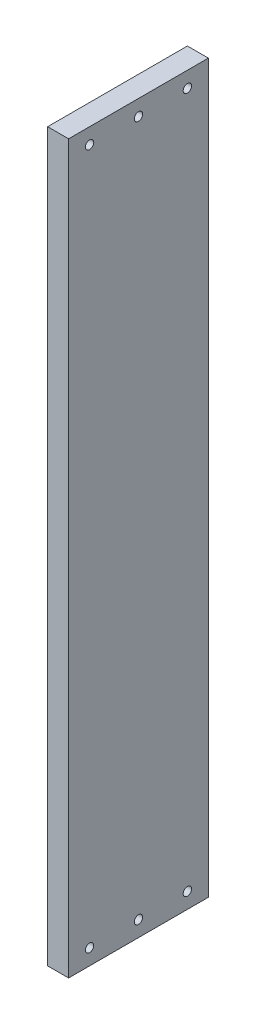
ISO-10303-21;
HEADER;
FILE_DESCRIPTION(('STEP AP214'),'2;1');
FILE_NAME('part.step','',(''),(''),'','','');
FILE_SCHEMA(('AUTOMOTIVE_DESIGN { 1 0 10303 214 1 1 1 1 }'));
ENDSEC;
DATA;
#1=APPLICATION_CONTEXT('core data for automotive mechanical design processes');
#2=APPLICATION_PROTOCOL_DEFINITION('international standard','automotive_design',2000,#1);
#3=PRODUCT_CONTEXT('',#1,'mechanical');
#4=PRODUCT('Part','Part','',(#3));
#5=PRODUCT_RELATED_PRODUCT_CATEGORY('part','',(#4));
#6=PRODUCT_DEFINITION_FORMATION('','',#4);
#7=PRODUCT_DEFINITION_CONTEXT('part definition',#1,'design');
#8=PRODUCT_DEFINITION('design','',#6,#7);
#9=PRODUCT_DEFINITION_SHAPE('','',#8);
#10=(LENGTH_UNIT() NAMED_UNIT(*) SI_UNIT(.MILLI.,.METRE.));
#11=(NAMED_UNIT(*) PLANE_ANGLE_UNIT() SI_UNIT($,.RADIAN.));
#12=(NAMED_UNIT(*) SI_UNIT($,.STERADIAN.) SOLID_ANGLE_UNIT());
#13=UNCERTAINTY_MEASURE_WITH_UNIT(LENGTH_MEASURE(1.E-05),#10,'distance_accuracy_value','');
#14=(GEOMETRIC_REPRESENTATION_CONTEXT(3) GLOBAL_UNCERTAINTY_ASSIGNED_CONTEXT((#13)) GLOBAL_UNIT_ASSIGNED_CONTEXT((#10,
#11,#12)) REPRESENTATION_CONTEXT('',''));
#15=CARTESIAN_POINT('',(0.,0.,0.));
#16=DIRECTION('',(0.,0.,1.));
#17=DIRECTION('',(1.,0.,0.));
#18=AXIS2_PLACEMENT_3D('',#15,#16,#17);
#19=CARTESIAN_POINT('',(0.,660.4,0.));
#20=DIRECTION('',(1.,0.,0.));
#21=DIRECTION('',(0.,0.,-1.));
#22=AXIS2_PLACEMENT_3D('',#19,#20,#21);
#23=PLANE('',#22);
#24=CARTESIAN_POINT('',(0.,14.224,-107.95));
#25=DIRECTION('',(1.,0.,0.));
#26=DIRECTION('',(0.,0.,-1.));
#27=AXIS2_PLACEMENT_3D('',#24,#25,#26);
#28=CIRCLE('',#27,3.81000000000003);
#29=CARTESIAN_POINT('',(0.,14.224,-111.76));
#30=VERTEX_POINT('',#29);
#31=EDGE_CURVE('E98',#30,#30,#28,.T.);
#32=ORIENTED_EDGE('',*,*,#31,.T.);
#33=EDGE_LOOP('',(#32));
#34=FACE_BOUND('',#33,.T.);
#35=CARTESIAN_POINT('',(0.,14.224,-63.5));
#36=DIRECTION('',(1.,0.,0.));
#37=DIRECTION('',(0.,0.,-1.));
#38=AXIS2_PLACEMENT_3D('',#35,#36,#37);
#39=CIRCLE('',#38,3.81000000000003);
#40=CARTESIAN_POINT('',(0.,14.224,-67.31));
#41=VERTEX_POINT('',#40);
#42=EDGE_CURVE('E111',#41,#41,#39,.T.);
#43=ORIENTED_EDGE('',*,*,#42,.T.);
#44=EDGE_LOOP('',(#43));
#45=FACE_BOUND('',#44,.T.);
#46=CARTESIAN_POINT('',(0.,14.224,-19.05));
#47=DIRECTION('',(1.,0.,0.));
#48=DIRECTION('',(0.,0.,-1.));
#49=AXIS2_PLACEMENT_3D('',#46,#47,#48);
#50=CIRCLE('',#49,3.81000000000003);
#51=CARTESIAN_POINT('',(0.,14.224,-22.86));
#52=VERTEX_POINT('',#51);
#53=EDGE_CURVE('E114',#52,#52,#50,.T.);
#54=ORIENTED_EDGE('',*,*,#53,.T.);
#55=EDGE_LOOP('',(#54));
#56=FACE_BOUND('',#55,.T.);
#57=CARTESIAN_POINT('',(0.,646.176,-19.05));
#58=DIRECTION('',(1.,0.,0.));
#59=DIRECTION('',(0.,0.,-1.));
#60=AXIS2_PLACEMENT_3D('',#57,#58,#59);
#61=CIRCLE('',#60,3.8100000000001);
#62=CARTESIAN_POINT('',(0.,646.176,-22.8600000000001));
#63=VERTEX_POINT('',#62);
#64=EDGE_CURVE('E117',#63,#63,#61,.T.);
#65=ORIENTED_EDGE('',*,*,#64,.T.);
#66=EDGE_LOOP('',(#65));
#67=FACE_BOUND('',#66,.T.);
#68=CARTESIAN_POINT('',(0.,646.176,-63.4999999999999));
#69=DIRECTION('',(1.,0.,0.));
#70=DIRECTION('',(0.,0.,-1.));
#71=AXIS2_PLACEMENT_3D('',#68,#69,#70);
#72=CIRCLE('',#71,3.81000000000003);
#73=CARTESIAN_POINT('',(0.,646.176,-67.3099999999999));
#74=VERTEX_POINT('',#73);
#75=EDGE_CURVE('E120',#74,#74,#72,.T.);
#76=ORIENTED_EDGE('',*,*,#75,.T.);
#77=EDGE_LOOP('',(#76));
#78=FACE_BOUND('',#77,.T.);
#79=CARTESIAN_POINT('',(0.,646.176,-107.95));
#80=DIRECTION('',(1.,0.,0.));
#81=DIRECTION('',(0.,0.,-1.));
#82=AXIS2_PLACEMENT_3D('',#79,#80,#81);
#83=CIRCLE('',#82,3.81000000000003);
#84=CARTESIAN_POINT('',(0.,646.176,-111.76));
#85=VERTEX_POINT('',#84);
#86=EDGE_CURVE('E123',#85,#85,#83,.T.);
#87=ORIENTED_EDGE('',*,*,#86,.T.);
#88=EDGE_LOOP('',(#87));
#89=FACE_BOUND('',#88,.T.);
#90=DIRECTION('',(0.,0.,1.));
#91=VECTOR('',#90,1.);
#92=CARTESIAN_POINT('',(0.,0.,0.));
#93=LINE('',#92,#91);
#94=CARTESIAN_POINT('',(0.,0.,-127.));
#95=VERTEX_POINT('',#94);
#96=CARTESIAN_POINT('',(0.,0.,0.));
#97=VERTEX_POINT('',#96);
#98=EDGE_CURVE('E95',#95,#97,#93,.T.);
#99=ORIENTED_EDGE('',*,*,#98,.T.);
#100=DIRECTION('',(0.,-1.,0.));
#101=VECTOR('',#100,1.);
#102=CARTESIAN_POINT('',(0.,660.4,0.));
#103=LINE('',#102,#101);
#104=CARTESIAN_POINT('',(0.,660.4,0.));
#105=VERTEX_POINT('',#104);
#106=EDGE_CURVE('E11',#105,#97,#103,.T.);
#107=ORIENTED_EDGE('',*,*,#106,.F.);
#108=DIRECTION('',(0.,0.,1.));
#109=VECTOR('',#108,1.);
#110=CARTESIAN_POINT('',(0.,660.4,0.));
#111=LINE('',#110,#109);
#112=CARTESIAN_POINT('',(0.,660.4,-127.));
#113=VERTEX_POINT('',#112);
#114=EDGE_CURVE('E83',#113,#105,#111,.T.);
#115=ORIENTED_EDGE('',*,*,#114,.F.);
#116=DIRECTION('',(0.,-1.,0.));
#117=VECTOR('',#116,1.);
#118=CARTESIAN_POINT('',(0.,660.4,-127.));
#119=LINE('',#118,#117);
#120=EDGE_CURVE('E91',#113,#95,#119,.T.);
#121=ORIENTED_EDGE('',*,*,#120,.T.);
#122=EDGE_LOOP('',(#99,#107,#115,#121));
#123=FACE_BOUND('',#122,.T.);
#124=ADVANCED_FACE('F32',(#34,#45,#56,#67,#78,#89,#123),#23,.F.);
#125=CARTESIAN_POINT('',(0.,660.4,0.));
#126=DIRECTION('',(0.,0.,-1.));
#127=DIRECTION('',(-1.,0.,0.));
#128=AXIS2_PLACEMENT_3D('',#125,#126,#127);
#129=PLANE('',#128);
#130=DIRECTION('',(1.,0.,0.));
#131=VECTOR('',#130,1.);
#132=CARTESIAN_POINT('',(0.,0.,0.));
#133=LINE('',#132,#131);
#134=CARTESIAN_POINT('',(19.05,0.,0.));
#135=VERTEX_POINT('',#134);
#136=EDGE_CURVE('E87',#97,#135,#133,.T.);
#137=ORIENTED_EDGE('',*,*,#136,.T.);
#138=DIRECTION('',(0.,-1.,0.));
#139=VECTOR('',#138,1.);
#140=CARTESIAN_POINT('',(19.05,660.4,0.));
#141=LINE('',#140,#139);
#142=CARTESIAN_POINT('',(19.05,660.4,0.));
#143=VERTEX_POINT('',#142);
#144=EDGE_CURVE('E40',#143,#135,#141,.T.);
#145=ORIENTED_EDGE('',*,*,#144,.F.);
#146=DIRECTION('',(1.,0.,0.));
#147=VECTOR('',#146,1.);
#148=CARTESIAN_POINT('',(0.,660.4,0.));
#149=LINE('',#148,#147);
#150=EDGE_CURVE('E78',#105,#143,#149,.T.);
#151=ORIENTED_EDGE('',*,*,#150,.F.);
#152=ORIENTED_EDGE('',*,*,#106,.T.);
#153=EDGE_LOOP('',(#137,#145,#151,#152));
#154=FACE_BOUND('',#153,.T.);
#155=ADVANCED_FACE('F86',(#154),#129,.F.);
#156=CARTESIAN_POINT('',(19.05,660.4,0.));
#157=DIRECTION('',(-1.,0.,0.));
#158=DIRECTION('',(0.,0.,1.));
#159=AXIS2_PLACEMENT_3D('',#156,#157,#158);
#160=PLANE('',#159);
#161=CARTESIAN_POINT('',(19.05,14.224,-107.95));
#162=DIRECTION('',(1.,0.,0.));
#163=DIRECTION('',(0.,0.,1.));
#164=AXIS2_PLACEMENT_3D('',#161,#162,#163);
#165=CIRCLE('',#164,3.81000000000003);
#166=CARTESIAN_POINT('',(19.05,14.224,-104.14));
#167=VERTEX_POINT('',#166);
#168=EDGE_CURVE('E130',#167,#167,#165,.T.);
#169=ORIENTED_EDGE('',*,*,#168,.F.);
#170=EDGE_LOOP('',(#169));
#171=FACE_BOUND('',#170,.T.);
#172=CARTESIAN_POINT('',(19.05,14.224,-63.5));
#173=DIRECTION('',(1.,0.,0.));
#174=DIRECTION('',(0.,0.,1.));
#175=AXIS2_PLACEMENT_3D('',#172,#173,#174);
#176=CIRCLE('',#175,3.81000000000003);
#177=CARTESIAN_POINT('',(19.05,14.224,-59.69));
#178=VERTEX_POINT('',#177);
#179=EDGE_CURVE('E133',#178,#178,#176,.T.);
#180=ORIENTED_EDGE('',*,*,#179,.F.);
#181=EDGE_LOOP('',(#180));
#182=FACE_BOUND('',#181,.T.);
#183=CARTESIAN_POINT('',(19.05,14.224,-19.05));
#184=DIRECTION('',(1.,0.,0.));
#185=DIRECTION('',(0.,0.,1.));
#186=AXIS2_PLACEMENT_3D('',#183,#184,#185);
#187=CIRCLE('',#186,3.81000000000003);
#188=CARTESIAN_POINT('',(19.05,14.224,-15.24));
#189=VERTEX_POINT('',#188);
#190=EDGE_CURVE('E136',#189,#189,#187,.T.);
#191=ORIENTED_EDGE('',*,*,#190,.F.);
#192=EDGE_LOOP('',(#191));
#193=FACE_BOUND('',#192,.T.);
#194=CARTESIAN_POINT('',(19.05,646.176,-19.05));
#195=DIRECTION('',(1.,0.,0.));
#196=DIRECTION('',(0.,0.,-1.));
#197=AXIS2_PLACEMENT_3D('',#194,#195,#196);
#198=CIRCLE('',#197,3.8100000000001);
#199=CARTESIAN_POINT('',(19.05,646.176,-22.8600000000001));
#200=VERTEX_POINT('',#199);
#201=EDGE_CURVE('E139',#200,#200,#198,.T.);
#202=ORIENTED_EDGE('',*,*,#201,.F.);
#203=EDGE_LOOP('',(#202));
#204=FACE_BOUND('',#203,.T.);
#205=CARTESIAN_POINT('',(19.05,646.176,-63.4999999999999));
#206=DIRECTION('',(1.,0.,0.));
#207=DIRECTION('',(0.,0.,-1.));
#208=AXIS2_PLACEMENT_3D('',#205,#206,#207);
#209=CIRCLE('',#208,3.81000000000003);
#210=CARTESIAN_POINT('',(19.05,646.176,-67.3099999999999));
#211=VERTEX_POINT('',#210);
#212=EDGE_CURVE('E129',#211,#211,#209,.T.);
#213=ORIENTED_EDGE('',*,*,#212,.F.);
#214=EDGE_LOOP('',(#213));
#215=FACE_BOUND('',#214,.T.);
#216=CARTESIAN_POINT('',(19.05,646.176,-107.95));
#217=DIRECTION('',(1.,0.,0.));
#218=DIRECTION('',(0.,0.,-1.));
#219=AXIS2_PLACEMENT_3D('',#216,#217,#218);
#220=CIRCLE('',#219,3.81000000000003);
#221=CARTESIAN_POINT('',(19.05,646.176,-111.76));
#222=VERTEX_POINT('',#221);
#223=EDGE_CURVE('E126',#222,#222,#220,.T.);
#224=ORIENTED_EDGE('',*,*,#223,.F.);
#225=EDGE_LOOP('',(#224));
#226=FACE_BOUND('',#225,.T.);
#227=DIRECTION('',(0.,0.,-1.));
#228=VECTOR('',#227,1.);
#229=CARTESIAN_POINT('',(19.05,0.,0.));
#230=LINE('',#229,#228);
#231=CARTESIAN_POINT('',(19.05,0.,-127.));
#232=VERTEX_POINT('',#231);
#233=EDGE_CURVE('E65',#135,#232,#230,.T.);
#234=ORIENTED_EDGE('',*,*,#233,.T.);
#235=DIRECTION('',(0.,-1.,0.));
#236=VECTOR('',#235,1.);
#237=CARTESIAN_POINT('',(19.05,660.4,-127.));
#238=LINE('',#237,#236);
#239=CARTESIAN_POINT('',(19.05,660.4,-127.));
#240=VERTEX_POINT('',#239);
#241=EDGE_CURVE('E88',#240,#232,#238,.T.);
#242=ORIENTED_EDGE('',*,*,#241,.F.);
#243=DIRECTION('',(0.,0.,-1.));
#244=VECTOR('',#243,1.);
#245=CARTESIAN_POINT('',(19.05,660.4,0.));
#246=LINE('',#245,#244);
#247=EDGE_CURVE('E81',#143,#240,#246,.T.);
#248=ORIENTED_EDGE('',*,*,#247,.F.);
#249=ORIENTED_EDGE('',*,*,#144,.T.);
#250=EDGE_LOOP('',(#234,#242,#248,#249));
#251=FACE_BOUND('',#250,.T.);
#252=ADVANCED_FACE('F89',(#171,#182,#193,#204,#215,#226,#251),#160,.F.);
#253=CARTESIAN_POINT('',(0.,660.4,-127.));
#254=DIRECTION('',(0.,0.,1.));
#255=DIRECTION('',(1.,0.,0.));
#256=AXIS2_PLACEMENT_3D('',#253,#254,#255);
#257=PLANE('',#256);
#258=DIRECTION('',(-1.,0.,0.));
#259=VECTOR('',#258,1.);
#260=CARTESIAN_POINT('',(0.,0.,-127.));
#261=LINE('',#260,#259);
#262=EDGE_CURVE('E71',#232,#95,#261,.T.);
#263=ORIENTED_EDGE('',*,*,#262,.T.);
#264=ORIENTED_EDGE('',*,*,#120,.F.);
#265=DIRECTION('',(-1.,0.,0.));
#266=VECTOR('',#265,1.);
#267=CARTESIAN_POINT('',(0.,660.4,-127.));
#268=LINE('',#267,#266);
#269=EDGE_CURVE('E48',#240,#113,#268,.T.);
#270=ORIENTED_EDGE('',*,*,#269,.F.);
#271=ORIENTED_EDGE('',*,*,#241,.T.);
#272=EDGE_LOOP('',(#263,#264,#270,#271));
#273=FACE_BOUND('',#272,.T.);
#274=ADVANCED_FACE('F103',(#273),#257,.F.);
#275=CARTESIAN_POINT('',(0.,660.4,0.));
#276=DIRECTION('',(0.,-1.,0.));
#277=DIRECTION('',(0.,0.,-1.));
#278=AXIS2_PLACEMENT_3D('',#275,#276,#277);
#279=PLANE('',#278);
#280=ORIENTED_EDGE('',*,*,#114,.T.);
#281=ORIENTED_EDGE('',*,*,#150,.T.);
#282=ORIENTED_EDGE('',*,*,#247,.T.);
#283=ORIENTED_EDGE('',*,*,#269,.T.);
#284=EDGE_LOOP('',(#280,#281,#282,#283));
#285=FACE_BOUND('',#284,.T.);
#286=ADVANCED_FACE('F79',(#285),#279,.F.);
#287=CARTESIAN_POINT('',(0.,0.,0.));
#288=DIRECTION('',(0.,-1.,0.));
#289=DIRECTION('',(0.,0.,-1.));
#290=AXIS2_PLACEMENT_3D('',#287,#288,#289);
#291=PLANE('',#290);
#292=ORIENTED_EDGE('',*,*,#98,.F.);
#293=ORIENTED_EDGE('',*,*,#262,.F.);
#294=ORIENTED_EDGE('',*,*,#233,.F.);
#295=ORIENTED_EDGE('',*,*,#136,.F.);
#296=EDGE_LOOP('',(#292,#293,#294,#295));
#297=FACE_BOUND('',#296,.T.);
#298=ADVANCED_FACE('F106',(#297),#291,.T.);
#299=CARTESIAN_POINT('',(-18.7959999999997,646.176,-107.95));
#300=DIRECTION('',(1.,0.,0.));
#301=DIRECTION('',(0.,0.,-1.));
#302=AXIS2_PLACEMENT_3D('',#299,#300,#301);
#303=CYLINDRICAL_SURFACE('',#302,3.81000000000003);
#304=ORIENTED_EDGE('',*,*,#223,.T.);
#305=EDGE_LOOP('',(#304));
#306=FACE_BOUND('',#305,.T.);
#307=ORIENTED_EDGE('',*,*,#86,.F.);
#308=EDGE_LOOP('',(#307));
#309=FACE_BOUND('',#308,.T.);
#310=ADVANCED_FACE('F154',(#306,#309),#303,.F.);
#311=CARTESIAN_POINT('',(-18.7959999999997,646.176,-63.4999999999999));
#312=DIRECTION('',(1.,0.,0.));
#313=DIRECTION('',(0.,0.,-1.));
#314=AXIS2_PLACEMENT_3D('',#311,#312,#313);
#315=CYLINDRICAL_SURFACE('',#314,3.81000000000003);
#316=ORIENTED_EDGE('',*,*,#212,.T.);
#317=EDGE_LOOP('',(#316));
#318=FACE_BOUND('',#317,.T.);
#319=ORIENTED_EDGE('',*,*,#75,.F.);
#320=EDGE_LOOP('',(#319));
#321=FACE_BOUND('',#320,.T.);
#322=ADVANCED_FACE('F145',(#318,#321),#315,.F.);
#323=CARTESIAN_POINT('',(-18.7959999999997,646.176,-19.05));
#324=DIRECTION('',(1.,0.,0.));
#325=DIRECTION('',(0.,0.,-1.));
#326=AXIS2_PLACEMENT_3D('',#323,#324,#325);
#327=CYLINDRICAL_SURFACE('',#326,3.8100000000001);
#328=ORIENTED_EDGE('',*,*,#201,.T.);
#329=EDGE_LOOP('',(#328));
#330=FACE_BOUND('',#329,.T.);
#331=ORIENTED_EDGE('',*,*,#64,.F.);
#332=EDGE_LOOP('',(#331));
#333=FACE_BOUND('',#332,.T.);
#334=ADVANCED_FACE('F175',(#330,#333),#327,.F.);
#335=CARTESIAN_POINT('',(-18.7959999999997,14.224,-19.05));
#336=DIRECTION('',(1.,0.,0.));
#337=DIRECTION('',(0.,0.,-1.));
#338=AXIS2_PLACEMENT_3D('',#335,#336,#337);
#339=CYLINDRICAL_SURFACE('',#338,3.81000000000003);
#340=ORIENTED_EDGE('',*,*,#190,.T.);
#341=EDGE_LOOP('',(#340));
#342=FACE_BOUND('',#341,.T.);
#343=ORIENTED_EDGE('',*,*,#53,.F.);
#344=EDGE_LOOP('',(#343));
#345=FACE_BOUND('',#344,.T.);
#346=ADVANCED_FACE('F180',(#342,#345),#339,.F.);
#347=CARTESIAN_POINT('',(-18.7959999999997,14.224,-63.5));
#348=DIRECTION('',(1.,0.,0.));
#349=DIRECTION('',(0.,0.,-1.));
#350=AXIS2_PLACEMENT_3D('',#347,#348,#349);
#351=CYLINDRICAL_SURFACE('',#350,3.81000000000003);
#352=ORIENTED_EDGE('',*,*,#179,.T.);
#353=EDGE_LOOP('',(#352));
#354=FACE_BOUND('',#353,.T.);
#355=ORIENTED_EDGE('',*,*,#42,.F.);
#356=EDGE_LOOP('',(#355));
#357=FACE_BOUND('',#356,.T.);
#358=ADVANCED_FACE('F186',(#354,#357),#351,.F.);
#359=CARTESIAN_POINT('',(-18.7959999999997,14.224,-107.95));
#360=DIRECTION('',(1.,0.,0.));
#361=DIRECTION('',(0.,0.,-1.));
#362=AXIS2_PLACEMENT_3D('',#359,#360,#361);
#363=CYLINDRICAL_SURFACE('',#362,3.81000000000003);
#364=ORIENTED_EDGE('',*,*,#168,.T.);
#365=EDGE_LOOP('',(#364));
#366=FACE_BOUND('',#365,.T.);
#367=ORIENTED_EDGE('',*,*,#31,.F.);
#368=EDGE_LOOP('',(#367));
#369=FACE_BOUND('',#368,.T.);
#370=ADVANCED_FACE('F190',(#366,#369),#363,.F.);
#371=CLOSED_SHELL('',(#124,#155,#252,#274,#286,#298,#310,#322,#334,#346,#358,#370));
#372=MANIFOLD_SOLID_BREP('B2',#371);
#373=ADVANCED_BREP_SHAPE_REPRESENTATION('',(#18,#372),#14);
#374=SHAPE_DEFINITION_REPRESENTATION(#9,#373);
ENDSEC;
END-ISO-10303-21;
